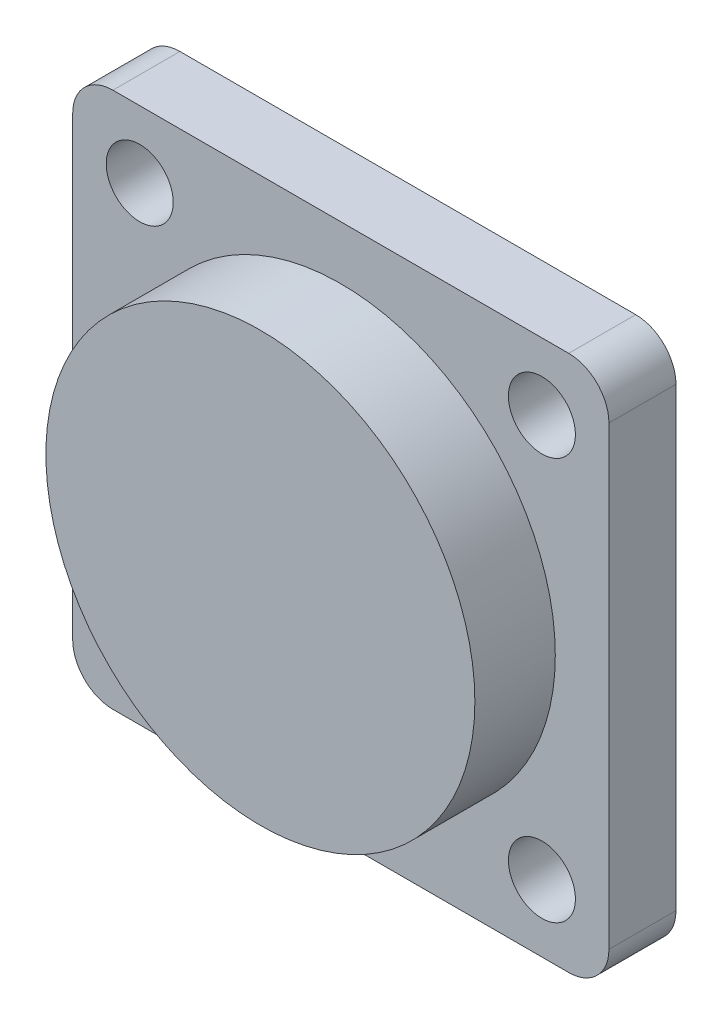
ISO-10303-21;
HEADER;
FILE_DESCRIPTION(('STEP AP214'),'2;1');
FILE_NAME('part.step','',(''),(''),'','','');
FILE_SCHEMA(('AUTOMOTIVE_DESIGN { 1 0 10303 214 1 1 1 1 }'));
ENDSEC;
DATA;
#1=APPLICATION_CONTEXT('core data for automotive mechanical design processes');
#2=APPLICATION_PROTOCOL_DEFINITION('international standard','automotive_design',2000,#1);
#3=PRODUCT_CONTEXT('',#1,'mechanical');
#4=PRODUCT('Part','Part','',(#3));
#5=PRODUCT_RELATED_PRODUCT_CATEGORY('part','',(#4));
#6=PRODUCT_DEFINITION_FORMATION('','',#4);
#7=PRODUCT_DEFINITION_CONTEXT('part definition',#1,'design');
#8=PRODUCT_DEFINITION('design','',#6,#7);
#9=PRODUCT_DEFINITION_SHAPE('','',#8);
#10=(LENGTH_UNIT() NAMED_UNIT(*) SI_UNIT(.MILLI.,.METRE.));
#11=(NAMED_UNIT(*) PLANE_ANGLE_UNIT() SI_UNIT($,.RADIAN.));
#12=(NAMED_UNIT(*) SI_UNIT($,.STERADIAN.) SOLID_ANGLE_UNIT());
#13=UNCERTAINTY_MEASURE_WITH_UNIT(LENGTH_MEASURE(1.E-05),#10,'distance_accuracy_value','');
#14=(GEOMETRIC_REPRESENTATION_CONTEXT(3) GLOBAL_UNCERTAINTY_ASSIGNED_CONTEXT((#13)) GLOBAL_UNIT_ASSIGNED_CONTEXT((#10,
#11,#12)) REPRESENTATION_CONTEXT('',''));
#15=CARTESIAN_POINT('',(0.,0.,0.));
#16=DIRECTION('',(0.,0.,1.));
#17=DIRECTION('',(1.,0.,0.));
#18=AXIS2_PLACEMENT_3D('',#15,#16,#17);
#19=CARTESIAN_POINT('',(0.,0.,5.));
#20=DIRECTION('',(0.,0.,1.));
#21=DIRECTION('',(1.,0.,0.));
#22=AXIS2_PLACEMENT_3D('',#19,#20,#21);
#23=PLANE('',#22);
#24=CARTESIAN_POINT('',(0.,0.,5.));
#25=DIRECTION('',(0.,0.,1.));
#26=DIRECTION('',(1.,0.,0.));
#27=AXIS2_PLACEMENT_3D('',#24,#25,#26);
#28=CIRCLE('',#27,16.);
#29=CARTESIAN_POINT('',(16.,0.,5.));
#30=VERTEX_POINT('',#29);
#31=EDGE_CURVE('E196',#30,#30,#28,.T.);
#32=ORIENTED_EDGE('',*,*,#31,.F.);
#33=EDGE_LOOP('',(#32));
#34=FACE_BOUND('',#33,.T.);
#35=CARTESIAN_POINT('',(15.,-15.,5.));
#36=DIRECTION('',(0.,0.,1.));
#37=DIRECTION('',(1.,0.,0.));
#38=AXIS2_PLACEMENT_3D('',#35,#36,#37);
#39=CIRCLE('',#38,2.5);
#40=CARTESIAN_POINT('',(17.5,-15.,5.));
#41=VERTEX_POINT('',#40);
#42=EDGE_CURVE('E181',#41,#41,#39,.T.);
#43=ORIENTED_EDGE('',*,*,#42,.F.);
#44=EDGE_LOOP('',(#43));
#45=FACE_BOUND('',#44,.T.);
#46=CARTESIAN_POINT('',(15.,15.,5.));
#47=DIRECTION('',(0.,0.,1.));
#48=DIRECTION('',(1.,0.,0.));
#49=AXIS2_PLACEMENT_3D('',#46,#47,#48);
#50=CIRCLE('',#49,2.5);
#51=CARTESIAN_POINT('',(17.5,15.,5.));
#52=VERTEX_POINT('',#51);
#53=EDGE_CURVE('E164',#52,#52,#50,.T.);
#54=ORIENTED_EDGE('',*,*,#53,.F.);
#55=EDGE_LOOP('',(#54));
#56=FACE_BOUND('',#55,.T.);
#57=DIRECTION('',(0.,-1.,0.));
#58=VECTOR('',#57,1.);
#59=CARTESIAN_POINT('',(-20.,20.,5.));
#60=LINE('',#59,#58);
#61=CARTESIAN_POINT('',(-20.,17.,5.));
#62=VERTEX_POINT('',#61);
#63=CARTESIAN_POINT('',(-20.,-17.,5.));
#64=VERTEX_POINT('',#63);
#65=EDGE_CURVE('E171',#62,#64,#60,.T.);
#66=ORIENTED_EDGE('',*,*,#65,.T.);
#67=CARTESIAN_POINT('',(-17.,-17.,5.));
#68=DIRECTION('',(0.,0.,1.));
#69=DIRECTION('',(1.,0.,0.));
#70=AXIS2_PLACEMENT_3D('',#67,#68,#69);
#71=CIRCLE('',#70,3.);
#72=CARTESIAN_POINT('',(-17.,-20.,5.));
#73=VERTEX_POINT('',#72);
#74=EDGE_CURVE('E148',#64,#73,#71,.T.);
#75=ORIENTED_EDGE('',*,*,#74,.T.);
#76=DIRECTION('',(1.,0.,0.));
#77=VECTOR('',#76,1.);
#78=CARTESIAN_POINT('',(-20.,-20.,5.));
#79=LINE('',#78,#77);
#80=CARTESIAN_POINT('',(17.,-20.,5.));
#81=VERTEX_POINT('',#80);
#82=EDGE_CURVE('E119',#73,#81,#79,.T.);
#83=ORIENTED_EDGE('',*,*,#82,.T.);
#84=CARTESIAN_POINT('',(17.,-17.,5.));
#85=DIRECTION('',(0.,0.,1.));
#86=DIRECTION('',(1.,0.,0.));
#87=AXIS2_PLACEMENT_3D('',#84,#85,#86);
#88=CIRCLE('',#87,3.);
#89=CARTESIAN_POINT('',(20.,-17.,5.));
#90=VERTEX_POINT('',#89);
#91=EDGE_CURVE('E146',#81,#90,#88,.T.);
#92=ORIENTED_EDGE('',*,*,#91,.T.);
#93=DIRECTION('',(0.,1.,0.));
#94=VECTOR('',#93,1.);
#95=CARTESIAN_POINT('',(20.,20.,5.));
#96=LINE('',#95,#94);
#97=CARTESIAN_POINT('',(20.,17.,5.));
#98=VERTEX_POINT('',#97);
#99=EDGE_CURVE('E126',#90,#98,#96,.T.);
#100=ORIENTED_EDGE('',*,*,#99,.T.);
#101=CARTESIAN_POINT('',(17.,17.,5.));
#102=DIRECTION('',(0.,0.,1.));
#103=DIRECTION('',(1.,0.,0.));
#104=AXIS2_PLACEMENT_3D('',#101,#102,#103);
#105=CIRCLE('',#104,3.);
#106=CARTESIAN_POINT('',(17.,20.,5.));
#107=VERTEX_POINT('',#106);
#108=EDGE_CURVE('E54',#98,#107,#105,.T.);
#109=ORIENTED_EDGE('',*,*,#108,.T.);
#110=DIRECTION('',(-1.,0.,0.));
#111=VECTOR('',#110,1.);
#112=CARTESIAN_POINT('',(-20.,20.,5.));
#113=LINE('',#112,#111);
#114=CARTESIAN_POINT('',(-17.,20.,5.));
#115=VERTEX_POINT('',#114);
#116=EDGE_CURVE('E129',#107,#115,#113,.T.);
#117=ORIENTED_EDGE('',*,*,#116,.T.);
#118=CARTESIAN_POINT('',(-17.,17.,5.));
#119=DIRECTION('',(0.,0.,1.));
#120=DIRECTION('',(1.,0.,0.));
#121=AXIS2_PLACEMENT_3D('',#118,#119,#120);
#122=CIRCLE('',#121,3.);
#123=EDGE_CURVE('E143',#115,#62,#122,.T.);
#124=ORIENTED_EDGE('',*,*,#123,.T.);
#125=EDGE_LOOP('',(#66,#75,#83,#92,#100,#109,#117,#124));
#126=FACE_BOUND('',#125,.T.);
#127=CARTESIAN_POINT('',(-15.,15.,5.));
#128=DIRECTION('',(0.,0.,1.));
#129=DIRECTION('',(1.,0.,0.));
#130=AXIS2_PLACEMENT_3D('',#127,#128,#129);
#131=CIRCLE('',#130,2.5);
#132=CARTESIAN_POINT('',(-12.5,15.,5.));
#133=VERTEX_POINT('',#132);
#134=EDGE_CURVE('E176',#133,#133,#131,.T.);
#135=ORIENTED_EDGE('',*,*,#134,.F.);
#136=EDGE_LOOP('',(#135));
#137=FACE_BOUND('',#136,.T.);
#138=CARTESIAN_POINT('',(-15.,-15.,5.));
#139=DIRECTION('',(0.,0.,1.));
#140=DIRECTION('',(1.,0.,0.));
#141=AXIS2_PLACEMENT_3D('',#138,#139,#140);
#142=CIRCLE('',#141,2.5);
#143=CARTESIAN_POINT('',(-12.5,-15.,5.));
#144=VERTEX_POINT('',#143);
#145=EDGE_CURVE('E187',#144,#144,#142,.T.);
#146=ORIENTED_EDGE('',*,*,#145,.F.);
#147=EDGE_LOOP('',(#146));
#148=FACE_BOUND('',#147,.T.);
#149=ADVANCED_FACE('F33',(#34,#45,#56,#126,#137,#148),#23,.T.);
#150=CARTESIAN_POINT('',(0.,0.,0.));
#151=DIRECTION('',(0.,0.,1.));
#152=DIRECTION('',(1.,0.,0.));
#153=AXIS2_PLACEMENT_3D('',#150,#151,#152);
#154=PLANE('',#153);
#155=DIRECTION('',(1.,0.,0.));
#156=VECTOR('',#155,1.);
#157=CARTESIAN_POINT('',(-20.,-20.,0.));
#158=LINE('',#157,#156);
#159=CARTESIAN_POINT('',(-17.,-20.,0.));
#160=VERTEX_POINT('',#159);
#161=CARTESIAN_POINT('',(17.,-20.,0.));
#162=VERTEX_POINT('',#161);
#163=EDGE_CURVE('E116',#160,#162,#158,.T.);
#164=ORIENTED_EDGE('',*,*,#163,.F.);
#165=CARTESIAN_POINT('',(-17.,-17.,0.));
#166=DIRECTION('',(0.,0.,1.));
#167=DIRECTION('',(1.,0.,0.));
#168=AXIS2_PLACEMENT_3D('',#165,#166,#167);
#169=CIRCLE('',#168,3.);
#170=CARTESIAN_POINT('',(-20.,-17.,0.));
#171=VERTEX_POINT('',#170);
#172=EDGE_CURVE('E99',#160,#171,#169,.F.);
#173=ORIENTED_EDGE('',*,*,#172,.T.);
#174=DIRECTION('',(0.,-1.,0.));
#175=VECTOR('',#174,1.);
#176=CARTESIAN_POINT('',(-20.,20.,0.));
#177=LINE('',#176,#175);
#178=CARTESIAN_POINT('',(-20.,17.,0.));
#179=VERTEX_POINT('',#178);
#180=EDGE_CURVE('E127',#179,#171,#177,.T.);
#181=ORIENTED_EDGE('',*,*,#180,.F.);
#182=CARTESIAN_POINT('',(-17.,17.,0.));
#183=DIRECTION('',(0.,0.,1.));
#184=DIRECTION('',(1.,0.,0.));
#185=AXIS2_PLACEMENT_3D('',#182,#183,#184);
#186=CIRCLE('',#185,3.);
#187=CARTESIAN_POINT('',(-17.,20.,0.));
#188=VERTEX_POINT('',#187);
#189=EDGE_CURVE('E120',#179,#188,#186,.F.);
#190=ORIENTED_EDGE('',*,*,#189,.T.);
#191=DIRECTION('',(-1.,0.,0.));
#192=VECTOR('',#191,1.);
#193=CARTESIAN_POINT('',(-20.,20.,0.));
#194=LINE('',#193,#192);
#195=CARTESIAN_POINT('',(17.,20.,0.));
#196=VERTEX_POINT('',#195);
#197=EDGE_CURVE('E131',#196,#188,#194,.T.);
#198=ORIENTED_EDGE('',*,*,#197,.F.);
#199=CARTESIAN_POINT('',(17.,17.,0.));
#200=DIRECTION('',(0.,0.,1.));
#201=DIRECTION('',(1.,0.,0.));
#202=AXIS2_PLACEMENT_3D('',#199,#200,#201);
#203=CIRCLE('',#202,3.);
#204=CARTESIAN_POINT('',(20.,17.,0.));
#205=VERTEX_POINT('',#204);
#206=EDGE_CURVE('E137',#196,#205,#203,.F.);
#207=ORIENTED_EDGE('',*,*,#206,.T.);
#208=DIRECTION('',(0.,1.,0.));
#209=VECTOR('',#208,1.);
#210=CARTESIAN_POINT('',(20.,20.,0.));
#211=LINE('',#210,#209);
#212=CARTESIAN_POINT('',(20.,-17.,0.));
#213=VERTEX_POINT('',#212);
#214=EDGE_CURVE('E159',#213,#205,#211,.T.);
#215=ORIENTED_EDGE('',*,*,#214,.F.);
#216=CARTESIAN_POINT('',(17.,-17.,0.));
#217=DIRECTION('',(0.,0.,1.));
#218=DIRECTION('',(1.,0.,0.));
#219=AXIS2_PLACEMENT_3D('',#216,#217,#218);
#220=CIRCLE('',#219,3.);
#221=EDGE_CURVE('E110',#213,#162,#220,.F.);
#222=ORIENTED_EDGE('',*,*,#221,.T.);
#223=EDGE_LOOP('',(#164,#173,#181,#190,#198,#207,#215,#222));
#224=FACE_BOUND('',#223,.T.);
#225=CARTESIAN_POINT('',(15.,15.,0.));
#226=DIRECTION('',(0.,0.,1.));
#227=DIRECTION('',(1.,0.,0.));
#228=AXIS2_PLACEMENT_3D('',#225,#226,#227);
#229=CIRCLE('',#228,2.5);
#230=CARTESIAN_POINT('',(17.5,15.,0.));
#231=VERTEX_POINT('',#230);
#232=EDGE_CURVE('E167',#231,#231,#229,.T.);
#233=ORIENTED_EDGE('',*,*,#232,.T.);
#234=EDGE_LOOP('',(#233));
#235=FACE_BOUND('',#234,.T.);
#236=CARTESIAN_POINT('',(-15.,15.,0.));
#237=DIRECTION('',(0.,0.,1.));
#238=DIRECTION('',(1.,0.,0.));
#239=AXIS2_PLACEMENT_3D('',#236,#237,#238);
#240=CIRCLE('',#239,2.5);
#241=CARTESIAN_POINT('',(-12.5,15.,0.));
#242=VERTEX_POINT('',#241);
#243=EDGE_CURVE('E178',#242,#242,#240,.T.);
#244=ORIENTED_EDGE('',*,*,#243,.T.);
#245=EDGE_LOOP('',(#244));
#246=FACE_BOUND('',#245,.T.);
#247=CARTESIAN_POINT('',(15.,-15.,0.));
#248=DIRECTION('',(0.,0.,1.));
#249=DIRECTION('',(1.,0.,0.));
#250=AXIS2_PLACEMENT_3D('',#247,#248,#249);
#251=CIRCLE('',#250,2.5);
#252=CARTESIAN_POINT('',(17.5,-15.,0.));
#253=VERTEX_POINT('',#252);
#254=EDGE_CURVE('E184',#253,#253,#251,.T.);
#255=ORIENTED_EDGE('',*,*,#254,.T.);
#256=EDGE_LOOP('',(#255));
#257=FACE_BOUND('',#256,.T.);
#258=CARTESIAN_POINT('',(-15.,-15.,0.));
#259=DIRECTION('',(0.,0.,1.));
#260=DIRECTION('',(1.,0.,0.));
#261=AXIS2_PLACEMENT_3D('',#258,#259,#260);
#262=CIRCLE('',#261,2.5);
#263=CARTESIAN_POINT('',(-12.5,-15.,0.));
#264=VERTEX_POINT('',#263);
#265=EDGE_CURVE('E190',#264,#264,#262,.T.);
#266=ORIENTED_EDGE('',*,*,#265,.T.);
#267=EDGE_LOOP('',(#266));
#268=FACE_BOUND('',#267,.T.);
#269=ADVANCED_FACE('F123',(#224,#235,#246,#257,#268),#154,.F.);
#270=CARTESIAN_POINT('',(20.,20.,5.));
#271=DIRECTION('',(-1.,0.,0.));
#272=DIRECTION('',(0.,0.,1.));
#273=AXIS2_PLACEMENT_3D('',#270,#271,#272);
#274=PLANE('',#273);
#275=ORIENTED_EDGE('',*,*,#99,.F.);
#276=DIRECTION('',(0.,0.,-1.));
#277=VECTOR('',#276,1.);
#278=CARTESIAN_POINT('',(20.,-17.,5.));
#279=LINE('',#278,#277);
#280=EDGE_CURVE('E152',#90,#213,#279,.T.);
#281=ORIENTED_EDGE('',*,*,#280,.T.);
#282=ORIENTED_EDGE('',*,*,#214,.T.);
#283=DIRECTION('',(0.,0.,-1.));
#284=VECTOR('',#283,1.);
#285=CARTESIAN_POINT('',(20.,17.,5.));
#286=LINE('',#285,#284);
#287=EDGE_CURVE('E150',#205,#98,#286,.F.);
#288=ORIENTED_EDGE('',*,*,#287,.T.);
#289=EDGE_LOOP('',(#275,#281,#282,#288));
#290=FACE_BOUND('',#289,.T.);
#291=ADVANCED_FACE('F158',(#290),#274,.F.);
#292=CARTESIAN_POINT('',(-20.,20.,5.));
#293=DIRECTION('',(0.,-1.,0.));
#294=DIRECTION('',(0.,0.,-1.));
#295=AXIS2_PLACEMENT_3D('',#292,#293,#294);
#296=PLANE('',#295);
#297=ORIENTED_EDGE('',*,*,#116,.F.);
#298=DIRECTION('',(0.,0.,-1.));
#299=VECTOR('',#298,1.);
#300=CARTESIAN_POINT('',(17.,20.,5.));
#301=LINE('',#300,#299);
#302=EDGE_CURVE('E11',#107,#196,#301,.T.);
#303=ORIENTED_EDGE('',*,*,#302,.T.);
#304=ORIENTED_EDGE('',*,*,#197,.T.);
#305=DIRECTION('',(0.,0.,-1.));
#306=VECTOR('',#305,1.);
#307=CARTESIAN_POINT('',(-17.,20.,5.));
#308=LINE('',#307,#306);
#309=EDGE_CURVE('E41',#188,#115,#308,.F.);
#310=ORIENTED_EDGE('',*,*,#309,.T.);
#311=EDGE_LOOP('',(#297,#303,#304,#310));
#312=FACE_BOUND('',#311,.T.);
#313=ADVANCED_FACE('F234',(#312),#296,.F.);
#314=CARTESIAN_POINT('',(-20.,20.,5.));
#315=DIRECTION('',(1.,0.,0.));
#316=DIRECTION('',(0.,0.,-1.));
#317=AXIS2_PLACEMENT_3D('',#314,#315,#316);
#318=PLANE('',#317);
#319=ORIENTED_EDGE('',*,*,#180,.T.);
#320=DIRECTION('',(0.,0.,-1.));
#321=VECTOR('',#320,1.);
#322=CARTESIAN_POINT('',(-20.,-17.,5.));
#323=LINE('',#322,#321);
#324=EDGE_CURVE('E104',#171,#64,#323,.F.);
#325=ORIENTED_EDGE('',*,*,#324,.T.);
#326=ORIENTED_EDGE('',*,*,#65,.F.);
#327=DIRECTION('',(0.,0.,-1.));
#328=VECTOR('',#327,1.);
#329=CARTESIAN_POINT('',(-20.,17.,5.));
#330=LINE('',#329,#328);
#331=EDGE_CURVE('E109',#62,#179,#330,.T.);
#332=ORIENTED_EDGE('',*,*,#331,.T.);
#333=EDGE_LOOP('',(#319,#325,#326,#332));
#334=FACE_BOUND('',#333,.T.);
#335=ADVANCED_FACE('F241',(#334),#318,.F.);
#336=CARTESIAN_POINT('',(-20.,-20.,5.));
#337=DIRECTION('',(0.,1.,0.));
#338=DIRECTION('',(0.,0.,1.));
#339=AXIS2_PLACEMENT_3D('',#336,#337,#338);
#340=PLANE('',#339);
#341=ORIENTED_EDGE('',*,*,#82,.F.);
#342=DIRECTION('',(0.,0.,-1.));
#343=VECTOR('',#342,1.);
#344=CARTESIAN_POINT('',(-17.,-20.,5.));
#345=LINE('',#344,#343);
#346=EDGE_CURVE('E103',#73,#160,#345,.T.);
#347=ORIENTED_EDGE('',*,*,#346,.T.);
#348=ORIENTED_EDGE('',*,*,#163,.T.);
#349=DIRECTION('',(0.,0.,-1.));
#350=VECTOR('',#349,1.);
#351=CARTESIAN_POINT('',(17.,-20.,5.));
#352=LINE('',#351,#350);
#353=EDGE_CURVE('E121',#162,#81,#352,.F.);
#354=ORIENTED_EDGE('',*,*,#353,.T.);
#355=EDGE_LOOP('',(#341,#347,#348,#354));
#356=FACE_BOUND('',#355,.T.);
#357=ADVANCED_FACE('F115',(#356),#340,.F.);
#358=CARTESIAN_POINT('',(15.,15.,5.));
#359=DIRECTION('',(0.,0.,-1.));
#360=DIRECTION('',(-1.,0.,0.));
#361=AXIS2_PLACEMENT_3D('',#358,#359,#360);
#362=CYLINDRICAL_SURFACE('',#361,2.5);
#363=ORIENTED_EDGE('',*,*,#53,.T.);
#364=EDGE_LOOP('',(#363));
#365=FACE_BOUND('',#364,.T.);
#366=ORIENTED_EDGE('',*,*,#232,.F.);
#367=EDGE_LOOP('',(#366));
#368=FACE_BOUND('',#367,.T.);
#369=ADVANCED_FACE('F240',(#365,#368),#362,.F.);
#370=CARTESIAN_POINT('',(-15.,15.,5.));
#371=DIRECTION('',(0.,0.,-1.));
#372=DIRECTION('',(-1.,0.,0.));
#373=AXIS2_PLACEMENT_3D('',#370,#371,#372);
#374=CYLINDRICAL_SURFACE('',#373,2.5);
#375=ORIENTED_EDGE('',*,*,#134,.T.);
#376=EDGE_LOOP('',(#375));
#377=FACE_BOUND('',#376,.T.);
#378=ORIENTED_EDGE('',*,*,#243,.F.);
#379=EDGE_LOOP('',(#378));
#380=FACE_BOUND('',#379,.T.);
#381=ADVANCED_FACE('F344',(#377,#380),#374,.F.);
#382=CARTESIAN_POINT('',(15.,-15.,5.));
#383=DIRECTION('',(0.,0.,-1.));
#384=DIRECTION('',(-1.,0.,0.));
#385=AXIS2_PLACEMENT_3D('',#382,#383,#384);
#386=CYLINDRICAL_SURFACE('',#385,2.5);
#387=ORIENTED_EDGE('',*,*,#42,.T.);
#388=EDGE_LOOP('',(#387));
#389=FACE_BOUND('',#388,.T.);
#390=ORIENTED_EDGE('',*,*,#254,.F.);
#391=EDGE_LOOP('',(#390));
#392=FACE_BOUND('',#391,.T.);
#393=ADVANCED_FACE('F225',(#389,#392),#386,.F.);
#394=CARTESIAN_POINT('',(-15.,-15.,5.));
#395=DIRECTION('',(0.,0.,-1.));
#396=DIRECTION('',(-1.,0.,0.));
#397=AXIS2_PLACEMENT_3D('',#394,#395,#396);
#398=CYLINDRICAL_SURFACE('',#397,2.5);
#399=ORIENTED_EDGE('',*,*,#145,.T.);
#400=EDGE_LOOP('',(#399));
#401=FACE_BOUND('',#400,.T.);
#402=ORIENTED_EDGE('',*,*,#265,.F.);
#403=EDGE_LOOP('',(#402));
#404=FACE_BOUND('',#403,.T.);
#405=ADVANCED_FACE('F207',(#401,#404),#398,.F.);
#406=CARTESIAN_POINT('',(0.,0.,11.));
#407=DIRECTION('',(0.,0.,-1.));
#408=DIRECTION('',(-1.,0.,0.));
#409=AXIS2_PLACEMENT_3D('',#406,#407,#408);
#410=CYLINDRICAL_SURFACE('',#409,16.);
#411=CARTESIAN_POINT('',(0.,0.,11.));
#412=DIRECTION('',(0.,0.,1.));
#413=DIRECTION('',(1.,0.,0.));
#414=AXIS2_PLACEMENT_3D('',#411,#412,#413);
#415=CIRCLE('',#414,16.);
#416=CARTESIAN_POINT('',(16.,0.,11.));
#417=VERTEX_POINT('',#416);
#418=EDGE_CURVE('E193',#417,#417,#415,.T.);
#419=ORIENTED_EDGE('',*,*,#418,.F.);
#420=EDGE_LOOP('',(#419));
#421=FACE_BOUND('',#420,.T.);
#422=ORIENTED_EDGE('',*,*,#31,.T.);
#423=EDGE_LOOP('',(#422));
#424=FACE_BOUND('',#423,.T.);
#425=ADVANCED_FACE('F204',(#421,#424),#410,.T.);
#426=CARTESIAN_POINT('',(0.,0.,11.));
#427=DIRECTION('',(0.,0.,1.));
#428=DIRECTION('',(1.,0.,0.));
#429=AXIS2_PLACEMENT_3D('',#426,#427,#428);
#430=PLANE('',#429);
#431=ORIENTED_EDGE('',*,*,#418,.T.);
#432=EDGE_LOOP('',(#431));
#433=FACE_BOUND('',#432,.T.);
#434=ADVANCED_FACE('F202',(#433),#430,.T.);
#435=CARTESIAN_POINT('',(-17.,-17.,5.));
#436=DIRECTION('',(0.,0.,-1.));
#437=DIRECTION('',(-1.,0.,0.));
#438=AXIS2_PLACEMENT_3D('',#435,#436,#437);
#439=CYLINDRICAL_SURFACE('',#438,3.);
#440=ORIENTED_EDGE('',*,*,#74,.F.);
#441=ORIENTED_EDGE('',*,*,#324,.F.);
#442=ORIENTED_EDGE('',*,*,#172,.F.);
#443=ORIENTED_EDGE('',*,*,#346,.F.);
#444=EDGE_LOOP('',(#440,#441,#442,#443));
#445=FACE_BOUND('',#444,.T.);
#446=ADVANCED_FACE('F102',(#445),#439,.T.);
#447=CARTESIAN_POINT('',(17.,-17.,5.));
#448=DIRECTION('',(0.,0.,-1.));
#449=DIRECTION('',(-1.,0.,0.));
#450=AXIS2_PLACEMENT_3D('',#447,#448,#449);
#451=CYLINDRICAL_SURFACE('',#450,3.);
#452=ORIENTED_EDGE('',*,*,#91,.F.);
#453=ORIENTED_EDGE('',*,*,#353,.F.);
#454=ORIENTED_EDGE('',*,*,#221,.F.);
#455=ORIENTED_EDGE('',*,*,#280,.F.);
#456=EDGE_LOOP('',(#452,#453,#454,#455));
#457=FACE_BOUND('',#456,.T.);
#458=ADVANCED_FACE('F249',(#457),#451,.T.);
#459=CARTESIAN_POINT('',(17.,17.,5.));
#460=DIRECTION('',(0.,0.,-1.));
#461=DIRECTION('',(-1.,0.,0.));
#462=AXIS2_PLACEMENT_3D('',#459,#460,#461);
#463=CYLINDRICAL_SURFACE('',#462,3.);
#464=ORIENTED_EDGE('',*,*,#108,.F.);
#465=ORIENTED_EDGE('',*,*,#287,.F.);
#466=ORIENTED_EDGE('',*,*,#206,.F.);
#467=ORIENTED_EDGE('',*,*,#302,.F.);
#468=EDGE_LOOP('',(#464,#465,#466,#467));
#469=FACE_BOUND('',#468,.T.);
#470=ADVANCED_FACE('F251',(#469),#463,.T.);
#471=CARTESIAN_POINT('',(-17.,17.,5.));
#472=DIRECTION('',(0.,0.,-1.));
#473=DIRECTION('',(-1.,0.,0.));
#474=AXIS2_PLACEMENT_3D('',#471,#472,#473);
#475=CYLINDRICAL_SURFACE('',#474,3.);
#476=ORIENTED_EDGE('',*,*,#123,.F.);
#477=ORIENTED_EDGE('',*,*,#309,.F.);
#478=ORIENTED_EDGE('',*,*,#189,.F.);
#479=ORIENTED_EDGE('',*,*,#331,.F.);
#480=EDGE_LOOP('',(#476,#477,#478,#479));
#481=FACE_BOUND('',#480,.T.);
#482=ADVANCED_FACE('F35',(#481),#475,.T.);
#483=CLOSED_SHELL('',(#149,#269,#291,#313,#335,#357,#369,#381,#393,#405,#425,#434,#446,#458,
#470,#482));
#484=MANIFOLD_SOLID_BREP('B2',#483);
#485=ADVANCED_BREP_SHAPE_REPRESENTATION('',(#18,#484),#14);
#486=SHAPE_DEFINITION_REPRESENTATION(#9,#485);
ENDSEC;
END-ISO-10303-21;
